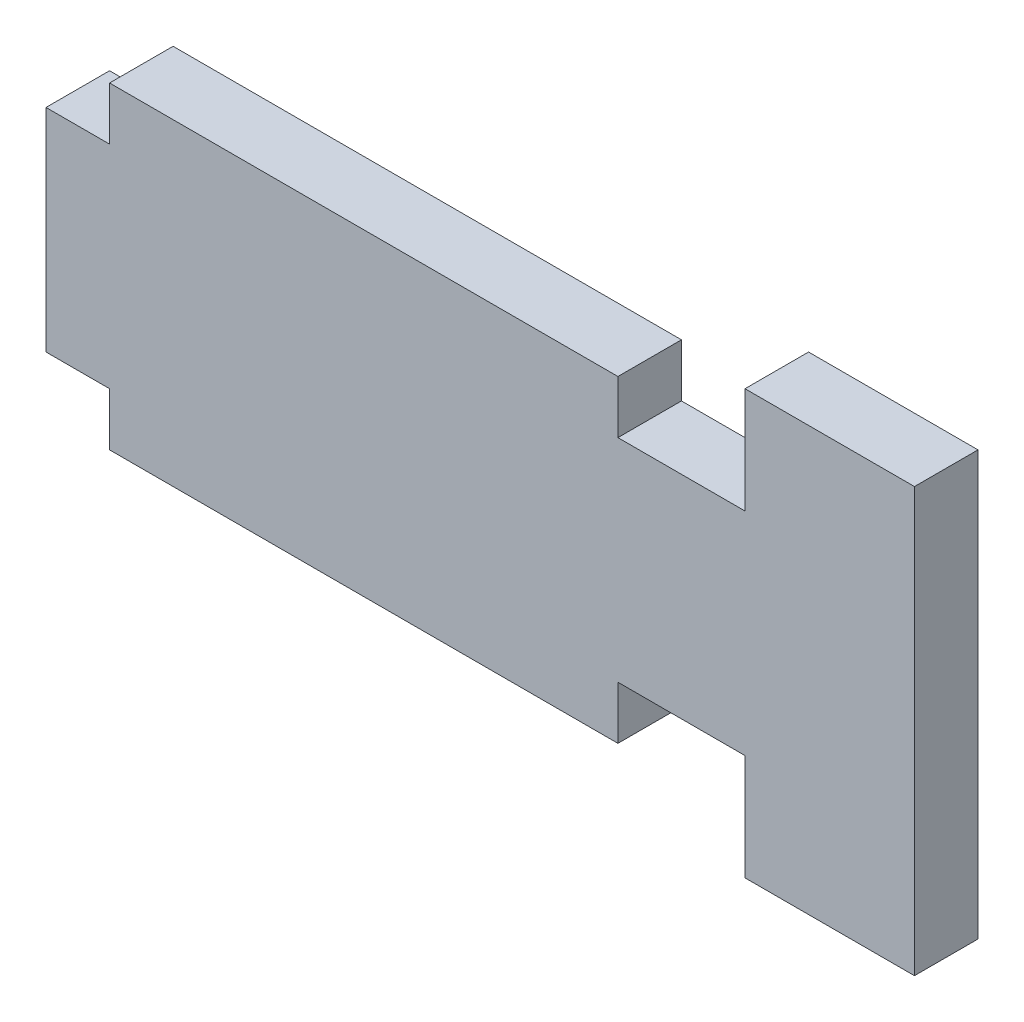
ISO-10303-21;
HEADER;
FILE_DESCRIPTION(('STEP AP214'),'2;1');
FILE_NAME('part.step','',(''),(''),'','','');
FILE_SCHEMA(('AUTOMOTIVE_DESIGN { 1 0 10303 214 1 1 1 1 }'));
ENDSEC;
DATA;
#1=APPLICATION_CONTEXT('core data for automotive mechanical design processes');
#2=APPLICATION_PROTOCOL_DEFINITION('international standard','automotive_design',2000,#1);
#3=PRODUCT_CONTEXT('',#1,'mechanical');
#4=PRODUCT('Part','Part','',(#3));
#5=PRODUCT_RELATED_PRODUCT_CATEGORY('part','',(#4));
#6=PRODUCT_DEFINITION_FORMATION('','',#4);
#7=PRODUCT_DEFINITION_CONTEXT('part definition',#1,'design');
#8=PRODUCT_DEFINITION('design','',#6,#7);
#9=PRODUCT_DEFINITION_SHAPE('','',#8);
#10=(LENGTH_UNIT() NAMED_UNIT(*) SI_UNIT(.MILLI.,.METRE.));
#11=(NAMED_UNIT(*) PLANE_ANGLE_UNIT() SI_UNIT($,.RADIAN.));
#12=(NAMED_UNIT(*) SI_UNIT($,.STERADIAN.) SOLID_ANGLE_UNIT());
#13=UNCERTAINTY_MEASURE_WITH_UNIT(LENGTH_MEASURE(1.E-05),#10,'distance_accuracy_value','');
#14=(GEOMETRIC_REPRESENTATION_CONTEXT(3) GLOBAL_UNCERTAINTY_ASSIGNED_CONTEXT((#13)) GLOBAL_UNIT_ASSIGNED_CONTEXT((#10,
#11,#12)) REPRESENTATION_CONTEXT('',''));
#15=CARTESIAN_POINT('',(0.,0.,0.));
#16=DIRECTION('',(0.,0.,1.));
#17=DIRECTION('',(1.,0.,0.));
#18=AXIS2_PLACEMENT_3D('',#15,#16,#17);
#19=CARTESIAN_POINT('',(0.,0.,0.));
#20=DIRECTION('',(0.,0.,1.));
#21=DIRECTION('',(1.,0.,0.));
#22=AXIS2_PLACEMENT_3D('',#19,#20,#21);
#23=PLANE('',#22);
#24=DIRECTION('',(1.,0.,0.));
#25=VECTOR('',#24,1.);
#26=CARTESIAN_POINT('',(0.,5.,0.));
#27=LINE('',#26,#25);
#28=CARTESIAN_POINT('',(-15.,5.,0.));
#29=VERTEX_POINT('',#28);
#30=CARTESIAN_POINT('',(-12.,5.,0.));
#31=VERTEX_POINT('',#30);
#32=EDGE_CURVE('E241',#29,#31,#27,.T.);
#33=ORIENTED_EDGE('',*,*,#32,.T.);
#34=DIRECTION('',(0.,1.,0.));
#35=VECTOR('',#34,1.);
#36=CARTESIAN_POINT('',(-12.,0.,0.));
#37=LINE('',#36,#35);
#38=CARTESIAN_POINT('',(-12.,7.5,0.));
#39=VERTEX_POINT('',#38);
#40=EDGE_CURVE('E253',#31,#39,#37,.T.);
#41=ORIENTED_EDGE('',*,*,#40,.T.);
#42=DIRECTION('',(1.,0.,0.));
#43=VECTOR('',#42,1.);
#44=CARTESIAN_POINT('',(0.,7.5,0.));
#45=LINE('',#44,#43);
#46=CARTESIAN_POINT('',(12.,7.5,0.));
#47=VERTEX_POINT('',#46);
#48=EDGE_CURVE('E276',#39,#47,#45,.T.);
#49=ORIENTED_EDGE('',*,*,#48,.T.);
#50=DIRECTION('',(0.,1.,0.));
#51=VECTOR('',#50,1.);
#52=CARTESIAN_POINT('',(12.,0.,0.));
#53=LINE('',#52,#51);
#54=CARTESIAN_POINT('',(12.,5.,0.));
#55=VERTEX_POINT('',#54);
#56=EDGE_CURVE('E228',#55,#47,#53,.T.);
#57=ORIENTED_EDGE('',*,*,#56,.F.);
#58=DIRECTION('',(-1.,0.,0.));
#59=VECTOR('',#58,1.);
#60=CARTESIAN_POINT('',(0.,5.00000000000001,0.));
#61=LINE('',#60,#59);
#62=CARTESIAN_POINT('',(18.,5.,0.));
#63=VERTEX_POINT('',#62);
#64=EDGE_CURVE('E274',#63,#55,#61,.T.);
#65=ORIENTED_EDGE('',*,*,#64,.F.);
#66=DIRECTION('',(0.,1.,0.));
#67=VECTOR('',#66,1.);
#68=CARTESIAN_POINT('',(18.,0.,0.));
#69=LINE('',#68,#67);
#70=CARTESIAN_POINT('',(18.,10.,0.));
#71=VERTEX_POINT('',#70);
#72=EDGE_CURVE('E265',#63,#71,#69,.T.);
#73=ORIENTED_EDGE('',*,*,#72,.T.);
#74=DIRECTION('',(1.,0.,0.));
#75=VECTOR('',#74,1.);
#76=CARTESIAN_POINT('',(0.,10.,0.));
#77=LINE('',#76,#75);
#78=CARTESIAN_POINT('',(26.,10.,0.));
#79=VERTEX_POINT('',#78);
#80=EDGE_CURVE('E271',#71,#79,#77,.T.);
#81=ORIENTED_EDGE('',*,*,#80,.T.);
#82=DIRECTION('',(0.,-1.,0.));
#83=VECTOR('',#82,1.);
#84=CARTESIAN_POINT('',(26.,0.,0.));
#85=LINE('',#84,#83);
#86=CARTESIAN_POINT('',(26.,-10.,0.));
#87=VERTEX_POINT('',#86);
#88=EDGE_CURVE('E268',#79,#87,#85,.T.);
#89=ORIENTED_EDGE('',*,*,#88,.T.);
#90=DIRECTION('',(-1.,0.,0.));
#91=VECTOR('',#90,1.);
#92=CARTESIAN_POINT('',(0.,-10.,0.));
#93=LINE('',#92,#91);
#94=CARTESIAN_POINT('',(18.,-10.,0.));
#95=VERTEX_POINT('',#94);
#96=EDGE_CURVE('E264',#87,#95,#93,.T.);
#97=ORIENTED_EDGE('',*,*,#96,.T.);
#98=CARTESIAN_POINT('',(18.,-5.,0.));
#99=VERTEX_POINT('',#98);
#100=EDGE_CURVE('E261',#95,#99,#69,.T.);
#101=ORIENTED_EDGE('',*,*,#100,.T.);
#102=DIRECTION('',(-1.,0.,0.));
#103=VECTOR('',#102,1.);
#104=CARTESIAN_POINT('',(0.,-4.99999999999999,0.));
#105=LINE('',#104,#103);
#106=CARTESIAN_POINT('',(12.,-5.,0.));
#107=VERTEX_POINT('',#106);
#108=EDGE_CURVE('E258',#99,#107,#105,.T.);
#109=ORIENTED_EDGE('',*,*,#108,.T.);
#110=CARTESIAN_POINT('',(12.,-7.5,0.));
#111=VERTEX_POINT('',#110);
#112=EDGE_CURVE('E255',#111,#107,#53,.T.);
#113=ORIENTED_EDGE('',*,*,#112,.F.);
#114=DIRECTION('',(1.,0.,0.));
#115=VECTOR('',#114,1.);
#116=CARTESIAN_POINT('',(0.,-7.5,0.));
#117=LINE('',#116,#115);
#118=CARTESIAN_POINT('',(-12.,-7.5,0.));
#119=VERTEX_POINT('',#118);
#120=EDGE_CURVE('E252',#119,#111,#117,.T.);
#121=ORIENTED_EDGE('',*,*,#120,.F.);
#122=CARTESIAN_POINT('',(-12.,-5.,0.));
#123=VERTEX_POINT('',#122);
#124=EDGE_CURVE('E249',#119,#123,#37,.T.);
#125=ORIENTED_EDGE('',*,*,#124,.T.);
#126=DIRECTION('',(1.,0.,0.));
#127=VECTOR('',#126,1.);
#128=CARTESIAN_POINT('',(0.,-5.,0.));
#129=LINE('',#128,#127);
#130=CARTESIAN_POINT('',(-15.,-5.,0.));
#131=VERTEX_POINT('',#130);
#132=EDGE_CURVE('E246',#131,#123,#129,.T.);
#133=ORIENTED_EDGE('',*,*,#132,.F.);
#134=DIRECTION('',(0.,1.,0.));
#135=VECTOR('',#134,1.);
#136=CARTESIAN_POINT('',(-15.,0.,0.));
#137=LINE('',#136,#135);
#138=EDGE_CURVE('E243',#131,#29,#137,.T.);
#139=ORIENTED_EDGE('',*,*,#138,.T.);
#140=EDGE_LOOP('',(#33,#41,#49,#57,#65,#73,#81,#89,#97,#101,#109,#113,#121,#125,#133,#139));
#141=FACE_BOUND('',#140,.T.);
#142=ADVANCED_FACE('F94',(#141),#23,.F.);
#143=CARTESIAN_POINT('',(0.,-5.,3.));
#144=DIRECTION('',(0.,1.,0.));
#145=DIRECTION('',(0.,0.,1.));
#146=AXIS2_PLACEMENT_3D('',#143,#144,#145);
#147=PLANE('',#146);
#148=ORIENTED_EDGE('',*,*,#132,.T.);
#149=DIRECTION('',(0.,0.,-1.));
#150=VECTOR('',#149,1.);
#151=CARTESIAN_POINT('',(-12.,-5.,3.));
#152=LINE('',#151,#150);
#153=CARTESIAN_POINT('',(-12.,-5.,3.));
#154=VERTEX_POINT('',#153);
#155=EDGE_CURVE('E300',#154,#123,#152,.T.);
#156=ORIENTED_EDGE('',*,*,#155,.F.);
#157=DIRECTION('',(1.,0.,0.));
#158=VECTOR('',#157,1.);
#159=CARTESIAN_POINT('',(0.,-5.,3.));
#160=LINE('',#159,#158);
#161=CARTESIAN_POINT('',(-15.,-5.,3.));
#162=VERTEX_POINT('',#161);
#163=EDGE_CURVE('E305',#162,#154,#160,.T.);
#164=ORIENTED_EDGE('',*,*,#163,.F.);
#165=DIRECTION('',(0.,0.,-1.));
#166=VECTOR('',#165,1.);
#167=CARTESIAN_POINT('',(-15.,-5.,3.));
#168=LINE('',#167,#166);
#169=EDGE_CURVE('E103',#162,#131,#168,.T.);
#170=ORIENTED_EDGE('',*,*,#169,.T.);
#171=EDGE_LOOP('',(#148,#156,#164,#170));
#172=FACE_BOUND('',#171,.T.);
#173=ADVANCED_FACE('F304',(#172),#147,.F.);
#174=CARTESIAN_POINT('',(-15.,0.,3.));
#175=DIRECTION('',(-1.,0.,0.));
#176=DIRECTION('',(0.,0.,1.));
#177=AXIS2_PLACEMENT_3D('',#174,#175,#176);
#178=PLANE('',#177);
#179=ORIENTED_EDGE('',*,*,#138,.F.);
#180=ORIENTED_EDGE('',*,*,#169,.F.);
#181=DIRECTION('',(0.,1.,0.));
#182=VECTOR('',#181,1.);
#183=CARTESIAN_POINT('',(-15.,0.,3.));
#184=LINE('',#183,#182);
#185=CARTESIAN_POINT('',(-15.,5.,3.));
#186=VERTEX_POINT('',#185);
#187=EDGE_CURVE('E314',#162,#186,#184,.T.);
#188=ORIENTED_EDGE('',*,*,#187,.T.);
#189=DIRECTION('',(0.,0.,-1.));
#190=VECTOR('',#189,1.);
#191=CARTESIAN_POINT('',(-15.,5.,3.));
#192=LINE('',#191,#190);
#193=EDGE_CURVE('E12',#186,#29,#192,.T.);
#194=ORIENTED_EDGE('',*,*,#193,.T.);
#195=EDGE_LOOP('',(#179,#180,#188,#194));
#196=FACE_BOUND('',#195,.T.);
#197=ADVANCED_FACE('F313',(#196),#178,.T.);
#198=CARTESIAN_POINT('',(0.,5.,3.));
#199=DIRECTION('',(0.,1.,0.));
#200=DIRECTION('',(0.,0.,1.));
#201=AXIS2_PLACEMENT_3D('',#198,#199,#200);
#202=PLANE('',#201);
#203=ORIENTED_EDGE('',*,*,#32,.F.);
#204=ORIENTED_EDGE('',*,*,#193,.F.);
#205=DIRECTION('',(1.,0.,0.));
#206=VECTOR('',#205,1.);
#207=CARTESIAN_POINT('',(0.,5.,3.));
#208=LINE('',#207,#206);
#209=CARTESIAN_POINT('',(-12.,5.,3.));
#210=VERTEX_POINT('',#209);
#211=EDGE_CURVE('E317',#186,#210,#208,.T.);
#212=ORIENTED_EDGE('',*,*,#211,.T.);
#213=DIRECTION('',(0.,0.,-1.));
#214=VECTOR('',#213,1.);
#215=CARTESIAN_POINT('',(-12.,5.,3.));
#216=LINE('',#215,#214);
#217=EDGE_CURVE('E111',#210,#31,#216,.T.);
#218=ORIENTED_EDGE('',*,*,#217,.T.);
#219=EDGE_LOOP('',(#203,#204,#212,#218));
#220=FACE_BOUND('',#219,.T.);
#221=ADVANCED_FACE('F96',(#220),#202,.T.);
#222=CARTESIAN_POINT('',(0.,0.,3.));
#223=DIRECTION('',(0.,0.,1.));
#224=DIRECTION('',(1.,0.,0.));
#225=AXIS2_PLACEMENT_3D('',#222,#223,#224);
#226=PLANE('',#225);
#227=ORIENTED_EDGE('',*,*,#163,.T.);
#228=DIRECTION('',(0.,1.,0.));
#229=VECTOR('',#228,1.);
#230=CARTESIAN_POINT('',(-12.,0.,3.));
#231=LINE('',#230,#229);
#232=CARTESIAN_POINT('',(-12.,-7.5,3.));
#233=VERTEX_POINT('',#232);
#234=EDGE_CURVE('E237',#233,#154,#231,.T.);
#235=ORIENTED_EDGE('',*,*,#234,.F.);
#236=DIRECTION('',(1.,0.,0.));
#237=VECTOR('',#236,1.);
#238=CARTESIAN_POINT('',(0.,-7.5,3.));
#239=LINE('',#238,#237);
#240=CARTESIAN_POINT('',(12.,-7.5,3.));
#241=VERTEX_POINT('',#240);
#242=EDGE_CURVE('E323',#233,#241,#239,.T.);
#243=ORIENTED_EDGE('',*,*,#242,.T.);
#244=DIRECTION('',(0.,1.,0.));
#245=VECTOR('',#244,1.);
#246=CARTESIAN_POINT('',(12.,0.,3.));
#247=LINE('',#246,#245);
#248=CARTESIAN_POINT('',(12.,-5.,3.));
#249=VERTEX_POINT('',#248);
#250=EDGE_CURVE('E223',#241,#249,#247,.T.);
#251=ORIENTED_EDGE('',*,*,#250,.T.);
#252=DIRECTION('',(-1.,0.,0.));
#253=VECTOR('',#252,1.);
#254=CARTESIAN_POINT('',(0.,-4.99999999999999,3.));
#255=LINE('',#254,#253);
#256=CARTESIAN_POINT('',(18.,-5.,3.));
#257=VERTEX_POINT('',#256);
#258=EDGE_CURVE('E325',#257,#249,#255,.T.);
#259=ORIENTED_EDGE('',*,*,#258,.F.);
#260=DIRECTION('',(0.,1.,0.));
#261=VECTOR('',#260,1.);
#262=CARTESIAN_POINT('',(18.,0.,3.));
#263=LINE('',#262,#261);
#264=CARTESIAN_POINT('',(18.,-10.,3.));
#265=VERTEX_POINT('',#264);
#266=EDGE_CURVE('E328',#265,#257,#263,.T.);
#267=ORIENTED_EDGE('',*,*,#266,.F.);
#268=DIRECTION('',(-1.,0.,0.));
#269=VECTOR('',#268,1.);
#270=CARTESIAN_POINT('',(0.,-10.,3.));
#271=LINE('',#270,#269);
#272=CARTESIAN_POINT('',(26.,-10.,3.));
#273=VERTEX_POINT('',#272);
#274=EDGE_CURVE('E331',#273,#265,#271,.T.);
#275=ORIENTED_EDGE('',*,*,#274,.F.);
#276=DIRECTION('',(0.,-1.,0.));
#277=VECTOR('',#276,1.);
#278=CARTESIAN_POINT('',(26.,0.,3.));
#279=LINE('',#278,#277);
#280=CARTESIAN_POINT('',(26.,10.,3.));
#281=VERTEX_POINT('',#280);
#282=EDGE_CURVE('E335',#281,#273,#279,.T.);
#283=ORIENTED_EDGE('',*,*,#282,.F.);
#284=DIRECTION('',(1.,0.,0.));
#285=VECTOR('',#284,1.);
#286=CARTESIAN_POINT('',(0.,10.,3.));
#287=LINE('',#286,#285);
#288=CARTESIAN_POINT('',(18.,10.,3.));
#289=VERTEX_POINT('',#288);
#290=EDGE_CURVE('E337',#289,#281,#287,.T.);
#291=ORIENTED_EDGE('',*,*,#290,.F.);
#292=CARTESIAN_POINT('',(18.,5.,3.));
#293=VERTEX_POINT('',#292);
#294=EDGE_CURVE('E332',#293,#289,#263,.T.);
#295=ORIENTED_EDGE('',*,*,#294,.F.);
#296=DIRECTION('',(-1.,0.,0.));
#297=VECTOR('',#296,1.);
#298=CARTESIAN_POINT('',(0.,5.00000000000001,3.));
#299=LINE('',#298,#297);
#300=CARTESIAN_POINT('',(12.,5.,3.));
#301=VERTEX_POINT('',#300);
#302=EDGE_CURVE('E218',#293,#301,#299,.T.);
#303=ORIENTED_EDGE('',*,*,#302,.T.);
#304=CARTESIAN_POINT('',(12.,7.5,3.));
#305=VERTEX_POINT('',#304);
#306=EDGE_CURVE('E209',#301,#305,#247,.T.);
#307=ORIENTED_EDGE('',*,*,#306,.T.);
#308=DIRECTION('',(1.,0.,0.));
#309=VECTOR('',#308,1.);
#310=CARTESIAN_POINT('',(0.,7.5,3.));
#311=LINE('',#310,#309);
#312=CARTESIAN_POINT('',(-12.,7.5,3.));
#313=VERTEX_POINT('',#312);
#314=EDGE_CURVE('E215',#313,#305,#311,.T.);
#315=ORIENTED_EDGE('',*,*,#314,.F.);
#316=EDGE_CURVE('E234',#210,#313,#231,.T.);
#317=ORIENTED_EDGE('',*,*,#316,.F.);
#318=ORIENTED_EDGE('',*,*,#211,.F.);
#319=ORIENTED_EDGE('',*,*,#187,.F.);
#320=EDGE_LOOP('',(#227,#235,#243,#251,#259,#267,#275,#283,#291,#295,#303,#307,#315,#317,#318,#319));
#321=FACE_BOUND('',#320,.T.);
#322=ADVANCED_FACE('F212',(#321),#226,.T.);
#323=CARTESIAN_POINT('',(-12.,0.,3.));
#324=DIRECTION('',(-1.,0.,0.));
#325=DIRECTION('',(0.,0.,1.));
#326=AXIS2_PLACEMENT_3D('',#323,#324,#325);
#327=PLANE('',#326);
#328=ORIENTED_EDGE('',*,*,#124,.F.);
#329=DIRECTION('',(0.,0.,-1.));
#330=VECTOR('',#329,1.);
#331=CARTESIAN_POINT('',(-12.,-7.5,3.));
#332=LINE('',#331,#330);
#333=EDGE_CURVE('E298',#233,#119,#332,.T.);
#334=ORIENTED_EDGE('',*,*,#333,.F.);
#335=ORIENTED_EDGE('',*,*,#234,.T.);
#336=ORIENTED_EDGE('',*,*,#155,.T.);
#337=EDGE_LOOP('',(#328,#334,#335,#336));
#338=FACE_BOUND('',#337,.T.);
#339=ADVANCED_FACE('F370',(#338),#327,.T.);
#340=CARTESIAN_POINT('',(0.,-7.5,3.));
#341=DIRECTION('',(0.,1.,0.));
#342=DIRECTION('',(0.,0.,1.));
#343=AXIS2_PLACEMENT_3D('',#340,#341,#342);
#344=PLANE('',#343);
#345=ORIENTED_EDGE('',*,*,#120,.T.);
#346=DIRECTION('',(0.,0.,-1.));
#347=VECTOR('',#346,1.);
#348=CARTESIAN_POINT('',(12.,-7.5,3.));
#349=LINE('',#348,#347);
#350=EDGE_CURVE('E295',#241,#111,#349,.T.);
#351=ORIENTED_EDGE('',*,*,#350,.F.);
#352=ORIENTED_EDGE('',*,*,#242,.F.);
#353=ORIENTED_EDGE('',*,*,#333,.T.);
#354=EDGE_LOOP('',(#345,#351,#352,#353));
#355=FACE_BOUND('',#354,.T.);
#356=ADVANCED_FACE('F378',(#355),#344,.F.);
#357=CARTESIAN_POINT('',(12.,0.,3.));
#358=DIRECTION('',(-1.,0.,0.));
#359=DIRECTION('',(0.,0.,1.));
#360=AXIS2_PLACEMENT_3D('',#357,#358,#359);
#361=PLANE('',#360);
#362=ORIENTED_EDGE('',*,*,#112,.T.);
#363=DIRECTION('',(0.,0.,-1.));
#364=VECTOR('',#363,1.);
#365=CARTESIAN_POINT('',(12.,-5.,3.));
#366=LINE('',#365,#364);
#367=EDGE_CURVE('E293',#249,#107,#366,.T.);
#368=ORIENTED_EDGE('',*,*,#367,.F.);
#369=ORIENTED_EDGE('',*,*,#250,.F.);
#370=ORIENTED_EDGE('',*,*,#350,.T.);
#371=EDGE_LOOP('',(#362,#368,#369,#370));
#372=FACE_BOUND('',#371,.T.);
#373=ADVANCED_FACE('F365',(#372),#361,.F.);
#374=CARTESIAN_POINT('',(0.,-4.99999999999999,3.));
#375=DIRECTION('',(0.,-1.,0.));
#376=DIRECTION('',(1.,0.,0.));
#377=AXIS2_PLACEMENT_3D('',#374,#375,#376);
#378=PLANE('',#377);
#379=ORIENTED_EDGE('',*,*,#108,.F.);
#380=DIRECTION('',(0.,0.,-1.));
#381=VECTOR('',#380,1.);
#382=CARTESIAN_POINT('',(18.,-5.,3.));
#383=LINE('',#382,#381);
#384=EDGE_CURVE('E291',#257,#99,#383,.T.);
#385=ORIENTED_EDGE('',*,*,#384,.F.);
#386=ORIENTED_EDGE('',*,*,#258,.T.);
#387=ORIENTED_EDGE('',*,*,#367,.T.);
#388=EDGE_LOOP('',(#379,#385,#386,#387));
#389=FACE_BOUND('',#388,.T.);
#390=ADVANCED_FACE('F445',(#389),#378,.T.);
#391=CARTESIAN_POINT('',(18.,0.,3.));
#392=DIRECTION('',(-1.,0.,0.));
#393=DIRECTION('',(0.,0.,1.));
#394=AXIS2_PLACEMENT_3D('',#391,#392,#393);
#395=PLANE('',#394);
#396=ORIENTED_EDGE('',*,*,#100,.F.);
#397=DIRECTION('',(0.,0.,-1.));
#398=VECTOR('',#397,1.);
#399=CARTESIAN_POINT('',(18.,-10.,3.));
#400=LINE('',#399,#398);
#401=EDGE_CURVE('E289',#265,#95,#400,.T.);
#402=ORIENTED_EDGE('',*,*,#401,.F.);
#403=ORIENTED_EDGE('',*,*,#266,.T.);
#404=ORIENTED_EDGE('',*,*,#384,.T.);
#405=EDGE_LOOP('',(#396,#402,#403,#404));
#406=FACE_BOUND('',#405,.T.);
#407=ADVANCED_FACE('F367',(#406),#395,.T.);
#408=CARTESIAN_POINT('',(0.,-10.,3.));
#409=DIRECTION('',(0.,-1.,0.));
#410=DIRECTION('',(0.,0.,-1.));
#411=AXIS2_PLACEMENT_3D('',#408,#409,#410);
#412=PLANE('',#411);
#413=ORIENTED_EDGE('',*,*,#96,.F.);
#414=DIRECTION('',(0.,0.,-1.));
#415=VECTOR('',#414,1.);
#416=CARTESIAN_POINT('',(26.,-10.,3.));
#417=LINE('',#416,#415);
#418=EDGE_CURVE('E287',#273,#87,#417,.T.);
#419=ORIENTED_EDGE('',*,*,#418,.F.);
#420=ORIENTED_EDGE('',*,*,#274,.T.);
#421=ORIENTED_EDGE('',*,*,#401,.T.);
#422=EDGE_LOOP('',(#413,#419,#420,#421));
#423=FACE_BOUND('',#422,.T.);
#424=ADVANCED_FACE('F427',(#423),#412,.T.);
#425=CARTESIAN_POINT('',(26.,0.,3.));
#426=DIRECTION('',(1.,0.,0.));
#427=DIRECTION('',(0.,0.,-1.));
#428=AXIS2_PLACEMENT_3D('',#425,#426,#427);
#429=PLANE('',#428);
#430=ORIENTED_EDGE('',*,*,#88,.F.);
#431=DIRECTION('',(0.,0.,-1.));
#432=VECTOR('',#431,1.);
#433=CARTESIAN_POINT('',(26.,10.,3.));
#434=LINE('',#433,#432);
#435=EDGE_CURVE('E285',#281,#79,#434,.T.);
#436=ORIENTED_EDGE('',*,*,#435,.F.);
#437=ORIENTED_EDGE('',*,*,#282,.T.);
#438=ORIENTED_EDGE('',*,*,#418,.T.);
#439=EDGE_LOOP('',(#430,#436,#437,#438));
#440=FACE_BOUND('',#439,.T.);
#441=ADVANCED_FACE('F351',(#440),#429,.T.);
#442=CARTESIAN_POINT('',(0.,10.,3.));
#443=DIRECTION('',(0.,1.,0.));
#444=DIRECTION('',(0.,0.,1.));
#445=AXIS2_PLACEMENT_3D('',#442,#443,#444);
#446=PLANE('',#445);
#447=ORIENTED_EDGE('',*,*,#80,.F.);
#448=DIRECTION('',(0.,0.,-1.));
#449=VECTOR('',#448,1.);
#450=CARTESIAN_POINT('',(18.,10.,3.));
#451=LINE('',#450,#449);
#452=EDGE_CURVE('E283',#289,#71,#451,.T.);
#453=ORIENTED_EDGE('',*,*,#452,.F.);
#454=ORIENTED_EDGE('',*,*,#290,.T.);
#455=ORIENTED_EDGE('',*,*,#435,.T.);
#456=EDGE_LOOP('',(#447,#453,#454,#455));
#457=FACE_BOUND('',#456,.T.);
#458=ADVANCED_FACE('F353',(#457),#446,.T.);
#459=ORIENTED_EDGE('',*,*,#72,.F.);
#460=DIRECTION('',(0.,0.,-1.));
#461=VECTOR('',#460,1.);
#462=CARTESIAN_POINT('',(18.,5.,3.));
#463=LINE('',#462,#461);
#464=EDGE_CURVE('E281',#293,#63,#463,.T.);
#465=ORIENTED_EDGE('',*,*,#464,.F.);
#466=ORIENTED_EDGE('',*,*,#294,.T.);
#467=ORIENTED_EDGE('',*,*,#452,.T.);
#468=EDGE_LOOP('',(#459,#465,#466,#467));
#469=FACE_BOUND('',#468,.T.);
#470=ADVANCED_FACE('F344',(#469),#395,.T.);
#471=CARTESIAN_POINT('',(0.,5.00000000000001,3.));
#472=DIRECTION('',(0.,-1.,0.));
#473=DIRECTION('',(1.,0.,0.));
#474=AXIS2_PLACEMENT_3D('',#471,#472,#473);
#475=PLANE('',#474);
#476=ORIENTED_EDGE('',*,*,#64,.T.);
#477=DIRECTION('',(0.,0.,-1.));
#478=VECTOR('',#477,1.);
#479=CARTESIAN_POINT('',(12.,5.,3.));
#480=LINE('',#479,#478);
#481=EDGE_CURVE('E231',#301,#55,#480,.T.);
#482=ORIENTED_EDGE('',*,*,#481,.F.);
#483=ORIENTED_EDGE('',*,*,#302,.F.);
#484=ORIENTED_EDGE('',*,*,#464,.T.);
#485=EDGE_LOOP('',(#476,#482,#483,#484));
#486=FACE_BOUND('',#485,.T.);
#487=ADVANCED_FACE('F357',(#486),#475,.F.);
#488=ORIENTED_EDGE('',*,*,#56,.T.);
#489=DIRECTION('',(0.,0.,-1.));
#490=VECTOR('',#489,1.);
#491=CARTESIAN_POINT('',(12.,7.5,3.));
#492=LINE('',#491,#490);
#493=EDGE_CURVE('E225',#305,#47,#492,.T.);
#494=ORIENTED_EDGE('',*,*,#493,.F.);
#495=ORIENTED_EDGE('',*,*,#306,.F.);
#496=ORIENTED_EDGE('',*,*,#481,.T.);
#497=EDGE_LOOP('',(#488,#494,#495,#496));
#498=FACE_BOUND('',#497,.T.);
#499=ADVANCED_FACE('F226',(#498),#361,.F.);
#500=CARTESIAN_POINT('',(0.,7.5,3.));
#501=DIRECTION('',(0.,1.,0.));
#502=DIRECTION('',(0.,0.,1.));
#503=AXIS2_PLACEMENT_3D('',#500,#501,#502);
#504=PLANE('',#503);
#505=ORIENTED_EDGE('',*,*,#48,.F.);
#506=DIRECTION('',(0.,0.,-1.));
#507=VECTOR('',#506,1.);
#508=CARTESIAN_POINT('',(-12.,7.5,3.));
#509=LINE('',#508,#507);
#510=EDGE_CURVE('E160',#313,#39,#509,.T.);
#511=ORIENTED_EDGE('',*,*,#510,.F.);
#512=ORIENTED_EDGE('',*,*,#314,.T.);
#513=ORIENTED_EDGE('',*,*,#493,.T.);
#514=EDGE_LOOP('',(#505,#511,#512,#513));
#515=FACE_BOUND('',#514,.T.);
#516=ADVANCED_FACE('F233',(#515),#504,.T.);
#517=ORIENTED_EDGE('',*,*,#40,.F.);
#518=ORIENTED_EDGE('',*,*,#217,.F.);
#519=ORIENTED_EDGE('',*,*,#316,.T.);
#520=ORIENTED_EDGE('',*,*,#510,.T.);
#521=EDGE_LOOP('',(#517,#518,#519,#520));
#522=FACE_BOUND('',#521,.T.);
#523=ADVANCED_FACE('F316',(#522),#327,.T.);
#524=CLOSED_SHELL('',(#142,#173,#197,#221,#322,#339,#356,#373,#390,#407,#424,#441,#458,#470,
#487,#499,#516,#523));
#525=MANIFOLD_SOLID_BREP('B2',#524);
#526=ADVANCED_BREP_SHAPE_REPRESENTATION('',(#18,#525),#14);
#527=SHAPE_DEFINITION_REPRESENTATION(#9,#526);
ENDSEC;
END-ISO-10303-21;
